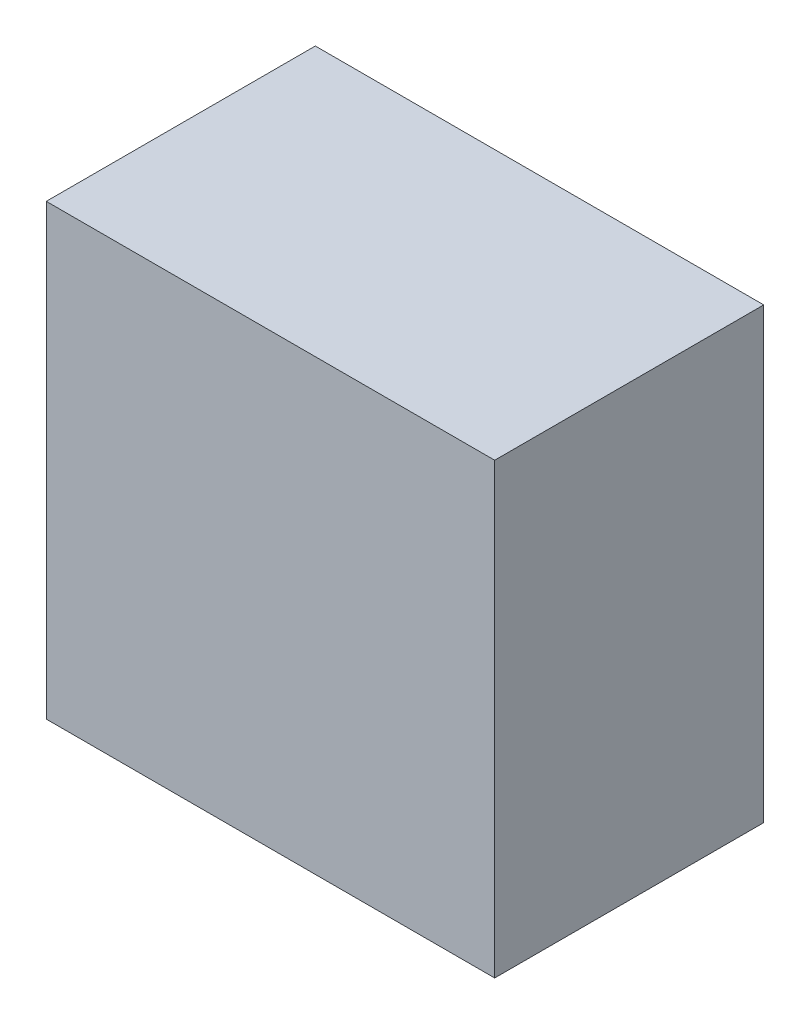
ISO-10303-21;
HEADER;
FILE_DESCRIPTION(('STEP AP214'),'2;1');
FILE_NAME('part.step','',(''),(''),'','','');
FILE_SCHEMA(('AUTOMOTIVE_DESIGN { 1 0 10303 214 1 1 1 1 }'));
ENDSEC;
DATA;
#1=APPLICATION_CONTEXT('core data for automotive mechanical design processes');
#2=APPLICATION_PROTOCOL_DEFINITION('international standard','automotive_design',2000,#1);
#3=PRODUCT_CONTEXT('',#1,'mechanical');
#4=PRODUCT('Part','Part','',(#3));
#5=PRODUCT_RELATED_PRODUCT_CATEGORY('part','',(#4));
#6=PRODUCT_DEFINITION_FORMATION('','',#4);
#7=PRODUCT_DEFINITION_CONTEXT('part definition',#1,'design');
#8=PRODUCT_DEFINITION('design','',#6,#7);
#9=PRODUCT_DEFINITION_SHAPE('','',#8);
#10=(LENGTH_UNIT() NAMED_UNIT(*) SI_UNIT(.MILLI.,.METRE.));
#11=(NAMED_UNIT(*) PLANE_ANGLE_UNIT() SI_UNIT($,.RADIAN.));
#12=(NAMED_UNIT(*) SI_UNIT($,.STERADIAN.) SOLID_ANGLE_UNIT());
#13=UNCERTAINTY_MEASURE_WITH_UNIT(LENGTH_MEASURE(1.E-05),#10,'distance_accuracy_value','');
#14=(GEOMETRIC_REPRESENTATION_CONTEXT(3) GLOBAL_UNCERTAINTY_ASSIGNED_CONTEXT((#13)) GLOBAL_UNIT_ASSIGNED_CONTEXT((#10,
#11,#12)) REPRESENTATION_CONTEXT('',''));
#15=CARTESIAN_POINT('',(0.,0.,0.));
#16=DIRECTION('',(0.,0.,1.));
#17=DIRECTION('',(1.,0.,0.));
#18=AXIS2_PLACEMENT_3D('',#15,#16,#17);
#19=CARTESIAN_POINT('',(25.,-25.,30.));
#20=DIRECTION('',(-1.,0.,0.));
#21=DIRECTION('',(0.,0.,1.));
#22=AXIS2_PLACEMENT_3D('',#19,#20,#21);
#23=PLANE('',#22);
#24=DIRECTION('',(0.,1.,0.));
#25=VECTOR('',#24,1.);
#26=CARTESIAN_POINT('',(25.,-25.,0.));
#27=LINE('',#26,#25);
#28=CARTESIAN_POINT('',(25.,-25.,0.));
#29=VERTEX_POINT('',#28);
#30=CARTESIAN_POINT('',(25.,25.,0.));
#31=VERTEX_POINT('',#30);
#32=EDGE_CURVE('E96',#29,#31,#27,.T.);
#33=ORIENTED_EDGE('',*,*,#32,.T.);
#34=DIRECTION('',(0.,0.,-1.));
#35=VECTOR('',#34,1.);
#36=CARTESIAN_POINT('',(25.,25.,30.));
#37=LINE('',#36,#35);
#38=CARTESIAN_POINT('',(25.,25.,30.));
#39=VERTEX_POINT('',#38);
#40=EDGE_CURVE('E11',#39,#31,#37,.T.);
#41=ORIENTED_EDGE('',*,*,#40,.F.);
#42=DIRECTION('',(0.,1.,0.));
#43=VECTOR('',#42,1.);
#44=CARTESIAN_POINT('',(25.,-25.,30.));
#45=LINE('',#44,#43);
#46=CARTESIAN_POINT('',(25.,-25.,30.));
#47=VERTEX_POINT('',#46);
#48=EDGE_CURVE('E84',#47,#39,#45,.T.);
#49=ORIENTED_EDGE('',*,*,#48,.F.);
#50=DIRECTION('',(0.,0.,-1.));
#51=VECTOR('',#50,1.);
#52=CARTESIAN_POINT('',(25.,-25.,30.));
#53=LINE('',#52,#51);
#54=EDGE_CURVE('E92',#47,#29,#53,.T.);
#55=ORIENTED_EDGE('',*,*,#54,.T.);
#56=EDGE_LOOP('',(#33,#41,#49,#55));
#57=FACE_BOUND('',#56,.T.);
#58=ADVANCED_FACE('F33',(#57),#23,.F.);
#59=CARTESIAN_POINT('',(-25.,25.,30.));
#60=DIRECTION('',(0.,-1.,0.));
#61=DIRECTION('',(0.,0.,-1.));
#62=AXIS2_PLACEMENT_3D('',#59,#60,#61);
#63=PLANE('',#62);
#64=DIRECTION('',(-1.,0.,0.));
#65=VECTOR('',#64,1.);
#66=CARTESIAN_POINT('',(-25.,25.,0.));
#67=LINE('',#66,#65);
#68=CARTESIAN_POINT('',(-25.,25.,0.));
#69=VERTEX_POINT('',#68);
#70=EDGE_CURVE('E88',#31,#69,#67,.T.);
#71=ORIENTED_EDGE('',*,*,#70,.T.);
#72=DIRECTION('',(0.,0.,-1.));
#73=VECTOR('',#72,1.);
#74=CARTESIAN_POINT('',(-25.,25.,30.));
#75=LINE('',#74,#73);
#76=CARTESIAN_POINT('',(-25.,25.,30.));
#77=VERTEX_POINT('',#76);
#78=EDGE_CURVE('E41',#77,#69,#75,.T.);
#79=ORIENTED_EDGE('',*,*,#78,.F.);
#80=DIRECTION('',(-1.,0.,0.));
#81=VECTOR('',#80,1.);
#82=CARTESIAN_POINT('',(-25.,25.,30.));
#83=LINE('',#82,#81);
#84=EDGE_CURVE('E79',#39,#77,#83,.T.);
#85=ORIENTED_EDGE('',*,*,#84,.F.);
#86=ORIENTED_EDGE('',*,*,#40,.T.);
#87=EDGE_LOOP('',(#71,#79,#85,#86));
#88=FACE_BOUND('',#87,.T.);
#89=ADVANCED_FACE('F87',(#88),#63,.F.);
#90=CARTESIAN_POINT('',(-25.,-25.,30.));
#91=DIRECTION('',(1.,0.,0.));
#92=DIRECTION('',(0.,0.,-1.));
#93=AXIS2_PLACEMENT_3D('',#90,#91,#92);
#94=PLANE('',#93);
#95=DIRECTION('',(0.,-1.,0.));
#96=VECTOR('',#95,1.);
#97=CARTESIAN_POINT('',(-25.,-25.,0.));
#98=LINE('',#97,#96);
#99=CARTESIAN_POINT('',(-25.,-25.,0.));
#100=VERTEX_POINT('',#99);
#101=EDGE_CURVE('E66',#69,#100,#98,.T.);
#102=ORIENTED_EDGE('',*,*,#101,.T.);
#103=DIRECTION('',(0.,0.,-1.));
#104=VECTOR('',#103,1.);
#105=CARTESIAN_POINT('',(-25.,-25.,30.));
#106=LINE('',#105,#104);
#107=CARTESIAN_POINT('',(-25.,-25.,30.));
#108=VERTEX_POINT('',#107);
#109=EDGE_CURVE('E89',#108,#100,#106,.T.);
#110=ORIENTED_EDGE('',*,*,#109,.F.);
#111=DIRECTION('',(0.,-1.,0.));
#112=VECTOR('',#111,1.);
#113=CARTESIAN_POINT('',(-25.,-25.,30.));
#114=LINE('',#113,#112);
#115=EDGE_CURVE('E82',#77,#108,#114,.T.);
#116=ORIENTED_EDGE('',*,*,#115,.F.);
#117=ORIENTED_EDGE('',*,*,#78,.T.);
#118=EDGE_LOOP('',(#102,#110,#116,#117));
#119=FACE_BOUND('',#118,.T.);
#120=ADVANCED_FACE('F90',(#119),#94,.F.);
#121=CARTESIAN_POINT('',(-25.,-25.,30.));
#122=DIRECTION('',(0.,1.,0.));
#123=DIRECTION('',(0.,0.,1.));
#124=AXIS2_PLACEMENT_3D('',#121,#122,#123);
#125=PLANE('',#124);
#126=DIRECTION('',(1.,0.,0.));
#127=VECTOR('',#126,1.);
#128=CARTESIAN_POINT('',(-25.,-25.,0.));
#129=LINE('',#128,#127);
#130=EDGE_CURVE('E72',#100,#29,#129,.T.);
#131=ORIENTED_EDGE('',*,*,#130,.T.);
#132=ORIENTED_EDGE('',*,*,#54,.F.);
#133=DIRECTION('',(1.,0.,0.));
#134=VECTOR('',#133,1.);
#135=CARTESIAN_POINT('',(-25.,-25.,30.));
#136=LINE('',#135,#134);
#137=EDGE_CURVE('E49',#108,#47,#136,.T.);
#138=ORIENTED_EDGE('',*,*,#137,.F.);
#139=ORIENTED_EDGE('',*,*,#109,.T.);
#140=EDGE_LOOP('',(#131,#132,#138,#139));
#141=FACE_BOUND('',#140,.T.);
#142=ADVANCED_FACE('F103',(#141),#125,.F.);
#143=CARTESIAN_POINT('',(0.,0.,30.));
#144=DIRECTION('',(0.,0.,-1.));
#145=DIRECTION('',(-1.,0.,0.));
#146=AXIS2_PLACEMENT_3D('',#143,#144,#145);
#147=PLANE('',#146);
#148=ORIENTED_EDGE('',*,*,#48,.T.);
#149=ORIENTED_EDGE('',*,*,#84,.T.);
#150=ORIENTED_EDGE('',*,*,#115,.T.);
#151=ORIENTED_EDGE('',*,*,#137,.T.);
#152=EDGE_LOOP('',(#148,#149,#150,#151));
#153=FACE_BOUND('',#152,.T.);
#154=ADVANCED_FACE('F80',(#153),#147,.F.);
#155=CARTESIAN_POINT('',(0.,0.,0.));
#156=DIRECTION('',(0.,0.,-1.));
#157=DIRECTION('',(-1.,0.,0.));
#158=AXIS2_PLACEMENT_3D('',#155,#156,#157);
#159=PLANE('',#158);
#160=ORIENTED_EDGE('',*,*,#32,.F.);
#161=ORIENTED_EDGE('',*,*,#130,.F.);
#162=ORIENTED_EDGE('',*,*,#101,.F.);
#163=ORIENTED_EDGE('',*,*,#70,.F.);
#164=EDGE_LOOP('',(#160,#161,#162,#163));
#165=FACE_BOUND('',#164,.T.);
#166=ADVANCED_FACE('F106',(#165),#159,.T.);
#167=CLOSED_SHELL('',(#58,#89,#120,#142,#154,#166));
#168=MANIFOLD_SOLID_BREP('B2',#167);
#169=ADVANCED_BREP_SHAPE_REPRESENTATION('',(#18,#168),#14);
#170=SHAPE_DEFINITION_REPRESENTATION(#9,#169);
ENDSEC;
END-ISO-10303-21;
